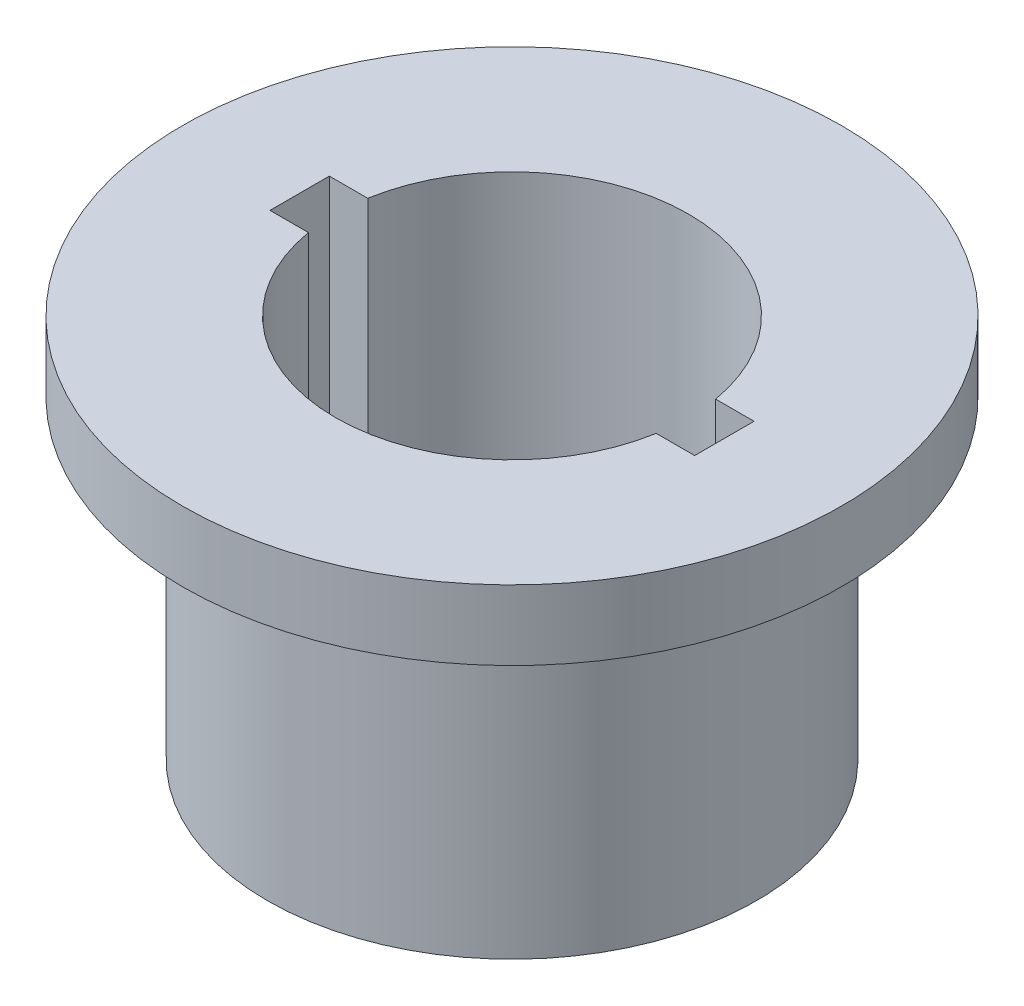
ISO-10303-21;
HEADER;
FILE_DESCRIPTION(('STEP AP214'),'2;1');
FILE_NAME('part.step','',(''),(''),'','','');
FILE_SCHEMA(('AUTOMOTIVE_DESIGN { 1 0 10303 214 1 1 1 1 }'));
ENDSEC;
DATA;
#1=APPLICATION_CONTEXT('core data for automotive mechanical design processes');
#2=APPLICATION_PROTOCOL_DEFINITION('international standard','automotive_design',2000,#1);
#3=PRODUCT_CONTEXT('',#1,'mechanical');
#4=PRODUCT('Part','Part','',(#3));
#5=PRODUCT_RELATED_PRODUCT_CATEGORY('part','',(#4));
#6=PRODUCT_DEFINITION_FORMATION('','',#4);
#7=PRODUCT_DEFINITION_CONTEXT('part definition',#1,'design');
#8=PRODUCT_DEFINITION('design','',#6,#7);
#9=PRODUCT_DEFINITION_SHAPE('','',#8);
#10=(LENGTH_UNIT() NAMED_UNIT(*) SI_UNIT(.MILLI.,.METRE.));
#11=(NAMED_UNIT(*) PLANE_ANGLE_UNIT() SI_UNIT($,.RADIAN.));
#12=(NAMED_UNIT(*) SI_UNIT($,.STERADIAN.) SOLID_ANGLE_UNIT());
#13=UNCERTAINTY_MEASURE_WITH_UNIT(LENGTH_MEASURE(1.E-05),#10,'distance_accuracy_value','');
#14=(GEOMETRIC_REPRESENTATION_CONTEXT(3) GLOBAL_UNCERTAINTY_ASSIGNED_CONTEXT((#13)) GLOBAL_UNIT_ASSIGNED_CONTEXT((#10,
#11,#12)) REPRESENTATION_CONTEXT('',''));
#15=CARTESIAN_POINT('',(0.,0.,0.));
#16=DIRECTION('',(0.,0.,1.));
#17=DIRECTION('',(1.,0.,0.));
#18=AXIS2_PLACEMENT_3D('',#15,#16,#17);
#19=CARTESIAN_POINT('',(0.,11.,0.));
#20=DIRECTION('',(0.,-1.,0.));
#21=DIRECTION('',(0.,0.,-1.));
#22=AXIS2_PLACEMENT_3D('',#19,#20,#21);
#23=CYLINDRICAL_SURFACE('',#22,7.);
#24=CARTESIAN_POINT('',(0.,0.,0.));
#25=DIRECTION('',(0.,1.,0.));
#26=DIRECTION('',(0.,0.,1.));
#27=AXIS2_PLACEMENT_3D('',#24,#25,#26);
#28=CIRCLE('',#27,7.);
#29=CARTESIAN_POINT('',(0.,0.,7.));
#30=VERTEX_POINT('',#29);
#31=EDGE_CURVE('E46',#30,#30,#28,.T.);
#32=ORIENTED_EDGE('',*,*,#31,.T.);
#33=EDGE_LOOP('',(#32));
#34=FACE_BOUND('',#33,.T.);
#35=CARTESIAN_POINT('',(0.,9.,0.));
#36=DIRECTION('',(0.,1.,0.));
#37=DIRECTION('',(0.,0.,1.));
#38=AXIS2_PLACEMENT_3D('',#35,#36,#37);
#39=CIRCLE('',#38,7.);
#40=CARTESIAN_POINT('',(0.,9.,7.));
#41=VERTEX_POINT('',#40);
#42=EDGE_CURVE('E11',#41,#41,#39,.T.);
#43=ORIENTED_EDGE('',*,*,#42,.F.);
#44=EDGE_LOOP('',(#43));
#45=FACE_BOUND('',#44,.T.);
#46=ADVANCED_FACE('F39',(#34,#45),#23,.T.);
#47=CARTESIAN_POINT('',(0.,11.,0.));
#48=DIRECTION('',(0.,1.,0.));
#49=DIRECTION('',(0.,0.,1.));
#50=AXIS2_PLACEMENT_3D('',#47,#48,#49);
#51=PLANE('',#50);
#52=DIRECTION('',(1.,0.,0.));
#53=VECTOR('',#52,1.);
#54=CARTESIAN_POINT('',(-6.07795138586146,11.,0.85));
#55=LINE('',#54,#53);
#56=CARTESIAN_POINT('',(-6.07795138586146,11.,0.85));
#57=VERTEX_POINT('',#56);
#58=CARTESIAN_POINT('',(-4.97795138586146,11.,0.849999999999998));
#59=VERTEX_POINT('',#58);
#60=EDGE_CURVE('E111',#57,#59,#55,.T.);
#61=ORIENTED_EDGE('',*,*,#60,.F.);
#62=DIRECTION('',(0.,0.,1.));
#63=VECTOR('',#62,1.);
#64=CARTESIAN_POINT('',(-6.07795138586146,11.,-0.85));
#65=LINE('',#64,#63);
#66=CARTESIAN_POINT('',(-6.07795138586146,11.,-0.85));
#67=VERTEX_POINT('',#66);
#68=EDGE_CURVE('E103',#67,#57,#65,.T.);
#69=ORIENTED_EDGE('',*,*,#68,.F.);
#70=DIRECTION('',(-1.,0.,0.));
#71=VECTOR('',#70,1.);
#72=CARTESIAN_POINT('',(-6.07795138586146,11.,-0.85));
#73=LINE('',#72,#71);
#74=CARTESIAN_POINT('',(-4.97795138586146,11.,-0.849999999999999));
#75=VERTEX_POINT('',#74);
#76=EDGE_CURVE('E138',#75,#67,#73,.T.);
#77=ORIENTED_EDGE('',*,*,#76,.F.);
#78=CARTESIAN_POINT('',(0.,11.,0.));
#79=DIRECTION('',(0.,1.,0.));
#80=DIRECTION('',(0.,0.,1.));
#81=AXIS2_PLACEMENT_3D('',#78,#79,#80);
#82=CIRCLE('',#81,5.05);
#83=CARTESIAN_POINT('',(4.97795138586146,11.,-0.85));
#84=VERTEX_POINT('',#83);
#85=EDGE_CURVE('E136',#84,#75,#82,.T.);
#86=ORIENTED_EDGE('',*,*,#85,.F.);
#87=DIRECTION('',(-1.,0.,0.));
#88=VECTOR('',#87,1.);
#89=CARTESIAN_POINT('',(4.97795138586146,11.,-0.85));
#90=LINE('',#89,#88);
#91=CARTESIAN_POINT('',(6.07795138586146,11.,-0.85));
#92=VERTEX_POINT('',#91);
#93=EDGE_CURVE('E134',#92,#84,#90,.T.);
#94=ORIENTED_EDGE('',*,*,#93,.F.);
#95=DIRECTION('',(0.,0.,-1.));
#96=VECTOR('',#95,1.);
#97=CARTESIAN_POINT('',(6.07795138586146,11.,-0.85));
#98=LINE('',#97,#96);
#99=CARTESIAN_POINT('',(6.07795138586146,11.,0.85));
#100=VERTEX_POINT('',#99);
#101=EDGE_CURVE('E132',#100,#92,#98,.T.);
#102=ORIENTED_EDGE('',*,*,#101,.F.);
#103=DIRECTION('',(1.,0.,0.));
#104=VECTOR('',#103,1.);
#105=CARTESIAN_POINT('',(4.97795138586146,11.,0.85));
#106=LINE('',#105,#104);
#107=CARTESIAN_POINT('',(4.97795138586146,11.,0.85));
#108=VERTEX_POINT('',#107);
#109=EDGE_CURVE('E127',#108,#100,#106,.T.);
#110=ORIENTED_EDGE('',*,*,#109,.F.);
#111=CARTESIAN_POINT('',(0.,11.,0.));
#112=DIRECTION('',(0.,1.,0.));
#113=DIRECTION('',(0.,0.,1.));
#114=AXIS2_PLACEMENT_3D('',#111,#112,#113);
#115=CIRCLE('',#114,5.05);
#116=EDGE_CURVE('E125',#59,#108,#115,.T.);
#117=ORIENTED_EDGE('',*,*,#116,.F.);
#118=EDGE_LOOP('',(#61,#69,#77,#86,#94,#102,#110,#117));
#119=FACE_BOUND('',#118,.T.);
#120=CARTESIAN_POINT('',(0.,11.,0.));
#121=DIRECTION('',(0.,1.,0.));
#122=DIRECTION('',(0.,0.,1.));
#123=AXIS2_PLACEMENT_3D('',#120,#121,#122);
#124=CIRCLE('',#123,9.43308735163181);
#125=CARTESIAN_POINT('',(0.,11.,9.43308735163181));
#126=VERTEX_POINT('',#125);
#127=EDGE_CURVE('E307',#126,#126,#124,.T.);
#128=ORIENTED_EDGE('',*,*,#127,.T.);
#129=EDGE_LOOP('',(#128));
#130=FACE_BOUND('',#129,.T.);
#131=ADVANCED_FACE('F122',(#119,#130),#51,.T.);
#132=CARTESIAN_POINT('',(0.,0.,0.));
#133=DIRECTION('',(0.,1.,0.));
#134=DIRECTION('',(0.,0.,1.));
#135=AXIS2_PLACEMENT_3D('',#132,#133,#134);
#136=PLANE('',#135);
#137=ORIENTED_EDGE('',*,*,#31,.F.);
#138=EDGE_LOOP('',(#137));
#139=FACE_BOUND('',#138,.T.);
#140=DIRECTION('',(0.,0.,1.));
#141=VECTOR('',#140,1.);
#142=CARTESIAN_POINT('',(-6.07795138586146,0.,-0.85));
#143=LINE('',#142,#141);
#144=CARTESIAN_POINT('',(-6.07795138586146,0.,-0.85));
#145=VERTEX_POINT('',#144);
#146=CARTESIAN_POINT('',(-6.07795138586146,0.,0.85));
#147=VERTEX_POINT('',#146);
#148=EDGE_CURVE('E61',#145,#147,#143,.T.);
#149=ORIENTED_EDGE('',*,*,#148,.T.);
#150=DIRECTION('',(1.,0.,0.));
#151=VECTOR('',#150,1.);
#152=CARTESIAN_POINT('',(-6.07795138586146,0.,0.85));
#153=LINE('',#152,#151);
#154=CARTESIAN_POINT('',(-4.97795138586146,0.,0.849999999999998));
#155=VERTEX_POINT('',#154);
#156=EDGE_CURVE('E118',#147,#155,#153,.T.);
#157=ORIENTED_EDGE('',*,*,#156,.T.);
#158=CARTESIAN_POINT('',(0.,0.,0.));
#159=DIRECTION('',(0.,1.,0.));
#160=DIRECTION('',(0.,0.,1.));
#161=AXIS2_PLACEMENT_3D('',#158,#159,#160);
#162=CIRCLE('',#161,5.05);
#163=CARTESIAN_POINT('',(4.97795138586146,0.,0.85));
#164=VERTEX_POINT('',#163);
#165=EDGE_CURVE('E143',#155,#164,#162,.T.);
#166=ORIENTED_EDGE('',*,*,#165,.T.);
#167=DIRECTION('',(1.,0.,0.));
#168=VECTOR('',#167,1.);
#169=CARTESIAN_POINT('',(4.97795138586146,0.,0.85));
#170=LINE('',#169,#168);
#171=CARTESIAN_POINT('',(6.07795138586146,0.,0.85));
#172=VERTEX_POINT('',#171);
#173=EDGE_CURVE('E146',#164,#172,#170,.T.);
#174=ORIENTED_EDGE('',*,*,#173,.T.);
#175=DIRECTION('',(0.,0.,-1.));
#176=VECTOR('',#175,1.);
#177=CARTESIAN_POINT('',(6.07795138586146,0.,-0.85));
#178=LINE('',#177,#176);
#179=CARTESIAN_POINT('',(6.07795138586146,0.,-0.85));
#180=VERTEX_POINT('',#179);
#181=EDGE_CURVE('E149',#172,#180,#178,.T.);
#182=ORIENTED_EDGE('',*,*,#181,.T.);
#183=DIRECTION('',(-1.,0.,0.));
#184=VECTOR('',#183,1.);
#185=CARTESIAN_POINT('',(4.97795138586146,0.,-0.85));
#186=LINE('',#185,#184);
#187=CARTESIAN_POINT('',(4.97795138586146,0.,-0.85));
#188=VERTEX_POINT('',#187);
#189=EDGE_CURVE('E152',#180,#188,#186,.T.);
#190=ORIENTED_EDGE('',*,*,#189,.T.);
#191=CARTESIAN_POINT('',(0.,0.,0.));
#192=DIRECTION('',(0.,1.,0.));
#193=DIRECTION('',(0.,0.,1.));
#194=AXIS2_PLACEMENT_3D('',#191,#192,#193);
#195=CIRCLE('',#194,5.05);
#196=CARTESIAN_POINT('',(-4.97795138586146,0.,-0.849999999999999));
#197=VERTEX_POINT('',#196);
#198=EDGE_CURVE('E155',#188,#197,#195,.T.);
#199=ORIENTED_EDGE('',*,*,#198,.T.);
#200=DIRECTION('',(-1.,0.,0.));
#201=VECTOR('',#200,1.);
#202=CARTESIAN_POINT('',(-6.07795138586146,0.,-0.85));
#203=LINE('',#202,#201);
#204=EDGE_CURVE('E112',#197,#145,#203,.T.);
#205=ORIENTED_EDGE('',*,*,#204,.T.);
#206=EDGE_LOOP('',(#149,#157,#166,#174,#182,#190,#199,#205));
#207=FACE_BOUND('',#206,.T.);
#208=ADVANCED_FACE('F175',(#139,#207),#136,.F.);
#209=CARTESIAN_POINT('',(-6.07795138586146,11.,-0.85));
#210=DIRECTION('',(1.,0.,0.));
#211=DIRECTION('',(0.,0.,-1.));
#212=AXIS2_PLACEMENT_3D('',#209,#210,#211);
#213=PLANE('',#212);
#214=ORIENTED_EDGE('',*,*,#148,.F.);
#215=DIRECTION('',(0.,-1.,0.));
#216=VECTOR('',#215,1.);
#217=CARTESIAN_POINT('',(-6.07795138586146,11.,-0.85));
#218=LINE('',#217,#216);
#219=EDGE_CURVE('E107',#67,#145,#218,.T.);
#220=ORIENTED_EDGE('',*,*,#219,.F.);
#221=ORIENTED_EDGE('',*,*,#68,.T.);
#222=DIRECTION('',(0.,-1.,0.));
#223=VECTOR('',#222,1.);
#224=CARTESIAN_POINT('',(-6.07795138586146,11.,0.85));
#225=LINE('',#224,#223);
#226=EDGE_CURVE('E106',#57,#147,#225,.T.);
#227=ORIENTED_EDGE('',*,*,#226,.T.);
#228=EDGE_LOOP('',(#214,#220,#221,#227));
#229=FACE_BOUND('',#228,.T.);
#230=ADVANCED_FACE('F105',(#229),#213,.T.);
#231=CARTESIAN_POINT('',(-6.07795138586146,11.,0.85));
#232=DIRECTION('',(0.,0.,-1.));
#233=DIRECTION('',(-1.,0.,0.));
#234=AXIS2_PLACEMENT_3D('',#231,#232,#233);
#235=PLANE('',#234);
#236=ORIENTED_EDGE('',*,*,#156,.F.);
#237=ORIENTED_EDGE('',*,*,#226,.F.);
#238=ORIENTED_EDGE('',*,*,#60,.T.);
#239=DIRECTION('',(0.,-1.,0.));
#240=VECTOR('',#239,1.);
#241=CARTESIAN_POINT('',(-4.97795138586146,11.,0.849999999999998));
#242=LINE('',#241,#240);
#243=EDGE_CURVE('E119',#59,#155,#242,.T.);
#244=ORIENTED_EDGE('',*,*,#243,.T.);
#245=EDGE_LOOP('',(#236,#237,#238,#244));
#246=FACE_BOUND('',#245,.T.);
#247=ADVANCED_FACE('F115',(#246),#235,.T.);
#248=CARTESIAN_POINT('',(0.,11.,0.));
#249=DIRECTION('',(0.,-1.,0.));
#250=DIRECTION('',(0.,0.,-1.));
#251=AXIS2_PLACEMENT_3D('',#248,#249,#250);
#252=CYLINDRICAL_SURFACE('',#251,5.05);
#253=ORIENTED_EDGE('',*,*,#165,.F.);
#254=ORIENTED_EDGE('',*,*,#243,.F.);
#255=ORIENTED_EDGE('',*,*,#116,.T.);
#256=DIRECTION('',(0.,-1.,0.));
#257=VECTOR('',#256,1.);
#258=CARTESIAN_POINT('',(4.97795138586146,11.,0.85));
#259=LINE('',#258,#257);
#260=EDGE_CURVE('E168',#108,#164,#259,.T.);
#261=ORIENTED_EDGE('',*,*,#260,.T.);
#262=EDGE_LOOP('',(#253,#254,#255,#261));
#263=FACE_BOUND('',#262,.T.);
#264=ADVANCED_FACE('F200',(#263),#252,.F.);
#265=CARTESIAN_POINT('',(4.97795138586146,11.,0.85));
#266=DIRECTION('',(0.,0.,-1.));
#267=DIRECTION('',(-1.,0.,0.));
#268=AXIS2_PLACEMENT_3D('',#265,#266,#267);
#269=PLANE('',#268);
#270=ORIENTED_EDGE('',*,*,#173,.F.);
#271=ORIENTED_EDGE('',*,*,#260,.F.);
#272=ORIENTED_EDGE('',*,*,#109,.T.);
#273=DIRECTION('',(0.,-1.,0.));
#274=VECTOR('',#273,1.);
#275=CARTESIAN_POINT('',(6.07795138586146,11.,0.85));
#276=LINE('',#275,#274);
#277=EDGE_CURVE('E166',#100,#172,#276,.T.);
#278=ORIENTED_EDGE('',*,*,#277,.T.);
#279=EDGE_LOOP('',(#270,#271,#272,#278));
#280=FACE_BOUND('',#279,.T.);
#281=ADVANCED_FACE('F197',(#280),#269,.T.);
#282=CARTESIAN_POINT('',(6.07795138586146,11.,-0.85));
#283=DIRECTION('',(-1.,0.,0.));
#284=DIRECTION('',(0.,0.,1.));
#285=AXIS2_PLACEMENT_3D('',#282,#283,#284);
#286=PLANE('',#285);
#287=ORIENTED_EDGE('',*,*,#181,.F.);
#288=ORIENTED_EDGE('',*,*,#277,.F.);
#289=ORIENTED_EDGE('',*,*,#101,.T.);
#290=DIRECTION('',(0.,-1.,0.));
#291=VECTOR('',#290,1.);
#292=CARTESIAN_POINT('',(6.07795138586146,11.,-0.85));
#293=LINE('',#292,#291);
#294=EDGE_CURVE('E164',#92,#180,#293,.T.);
#295=ORIENTED_EDGE('',*,*,#294,.T.);
#296=EDGE_LOOP('',(#287,#288,#289,#295));
#297=FACE_BOUND('',#296,.T.);
#298=ADVANCED_FACE('F192',(#297),#286,.T.);
#299=CARTESIAN_POINT('',(4.97795138586146,11.,-0.85));
#300=DIRECTION('',(0.,0.,1.));
#301=DIRECTION('',(1.,0.,0.));
#302=AXIS2_PLACEMENT_3D('',#299,#300,#301);
#303=PLANE('',#302);
#304=ORIENTED_EDGE('',*,*,#189,.F.);
#305=ORIENTED_EDGE('',*,*,#294,.F.);
#306=ORIENTED_EDGE('',*,*,#93,.T.);
#307=DIRECTION('',(0.,-1.,0.));
#308=VECTOR('',#307,1.);
#309=CARTESIAN_POINT('',(4.97795138586146,11.,-0.85));
#310=LINE('',#309,#308);
#311=EDGE_CURVE('E162',#84,#188,#310,.T.);
#312=ORIENTED_EDGE('',*,*,#311,.T.);
#313=EDGE_LOOP('',(#304,#305,#306,#312));
#314=FACE_BOUND('',#313,.T.);
#315=ADVANCED_FACE('F188',(#314),#303,.T.);
#316=CARTESIAN_POINT('',(0.,11.,0.));
#317=DIRECTION('',(0.,-1.,0.));
#318=DIRECTION('',(0.,0.,-1.));
#319=AXIS2_PLACEMENT_3D('',#316,#317,#318);
#320=CYLINDRICAL_SURFACE('',#319,5.05);
#321=ORIENTED_EDGE('',*,*,#198,.F.);
#322=ORIENTED_EDGE('',*,*,#311,.F.);
#323=ORIENTED_EDGE('',*,*,#85,.T.);
#324=DIRECTION('',(0.,-1.,0.));
#325=VECTOR('',#324,1.);
#326=CARTESIAN_POINT('',(-4.97795138586146,11.,-0.849999999999999));
#327=LINE('',#326,#325);
#328=EDGE_CURVE('E53',#75,#197,#327,.T.);
#329=ORIENTED_EDGE('',*,*,#328,.T.);
#330=EDGE_LOOP('',(#321,#322,#323,#329));
#331=FACE_BOUND('',#330,.T.);
#332=ADVANCED_FACE('F185',(#331),#320,.F.);
#333=CARTESIAN_POINT('',(-6.07795138586146,11.,-0.85));
#334=DIRECTION('',(0.,0.,1.));
#335=DIRECTION('',(1.,0.,0.));
#336=AXIS2_PLACEMENT_3D('',#333,#334,#335);
#337=PLANE('',#336);
#338=ORIENTED_EDGE('',*,*,#204,.F.);
#339=ORIENTED_EDGE('',*,*,#328,.F.);
#340=ORIENTED_EDGE('',*,*,#76,.T.);
#341=ORIENTED_EDGE('',*,*,#219,.T.);
#342=EDGE_LOOP('',(#338,#339,#340,#341));
#343=FACE_BOUND('',#342,.T.);
#344=ADVANCED_FACE('F179',(#343),#337,.T.);
#345=CARTESIAN_POINT('',(0.,9.,0.));
#346=DIRECTION('',(0.,1.,0.));
#347=DIRECTION('',(0.,0.,1.));
#348=AXIS2_PLACEMENT_3D('',#345,#346,#347);
#349=CYLINDRICAL_SURFACE('',#348,9.43308735163181);
#350=CARTESIAN_POINT('',(0.,9.,0.));
#351=DIRECTION('',(0.,1.,0.));
#352=DIRECTION('',(0.,0.,1.));
#353=AXIS2_PLACEMENT_3D('',#350,#351,#352);
#354=CIRCLE('',#353,9.43308735163181);
#355=CARTESIAN_POINT('',(0.,9.,9.43308735163181));
#356=VERTEX_POINT('',#355);
#357=EDGE_CURVE('E141',#356,#356,#354,.T.);
#358=ORIENTED_EDGE('',*,*,#357,.T.);
#359=EDGE_LOOP('',(#358));
#360=FACE_BOUND('',#359,.T.);
#361=ORIENTED_EDGE('',*,*,#127,.F.);
#362=EDGE_LOOP('',(#361));
#363=FACE_BOUND('',#362,.T.);
#364=ADVANCED_FACE('F272',(#360,#363),#349,.T.);
#365=CARTESIAN_POINT('',(0.,9.,0.));
#366=DIRECTION('',(0.,1.,0.));
#367=DIRECTION('',(0.,0.,1.));
#368=AXIS2_PLACEMENT_3D('',#365,#366,#367);
#369=PLANE('',#368);
#370=ORIENTED_EDGE('',*,*,#42,.T.);
#371=EDGE_LOOP('',(#370));
#372=FACE_BOUND('',#371,.T.);
#373=ORIENTED_EDGE('',*,*,#357,.F.);
#374=EDGE_LOOP('',(#373));
#375=FACE_BOUND('',#374,.T.);
#376=ADVANCED_FACE('F290',(#372,#375),#369,.F.);
#377=CLOSED_SHELL('',(#46,#131,#208,#230,#247,#264,#281,#298,#315,#332,#344,#364,#376));
#378=MANIFOLD_SOLID_BREP('B2',#377);
#379=ADVANCED_BREP_SHAPE_REPRESENTATION('',(#18,#378),#14);
#380=SHAPE_DEFINITION_REPRESENTATION(#9,#379);
ENDSEC;
END-ISO-10303-21;
